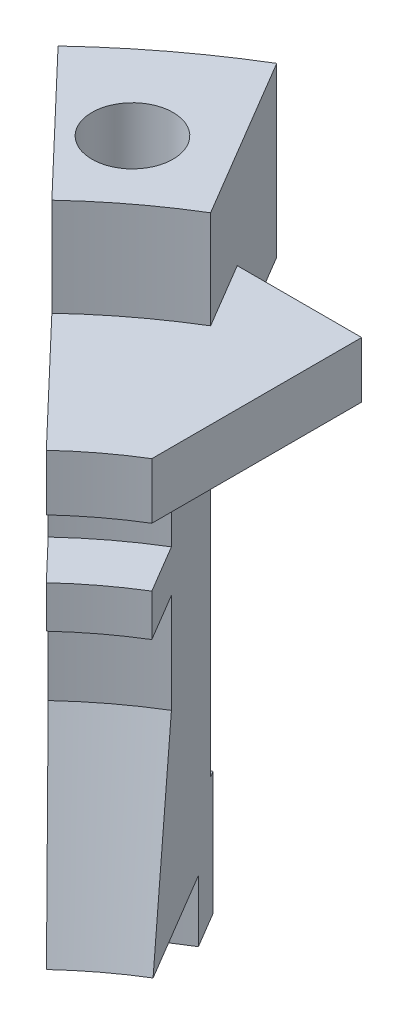
ISO-10303-21;
HEADER;
FILE_DESCRIPTION(('STEP AP214'),'2;1');
FILE_NAME('part.step','',(''),(''),'','','');
FILE_SCHEMA(('AUTOMOTIVE_DESIGN { 1 0 10303 214 1 1 1 1 }'));
ENDSEC;
DATA;
#1=APPLICATION_CONTEXT('core data for automotive mechanical design processes');
#2=APPLICATION_PROTOCOL_DEFINITION('international standard','automotive_design',2000,#1);
#3=PRODUCT_CONTEXT('',#1,'mechanical');
#4=PRODUCT('Part','Part','',(#3));
#5=PRODUCT_RELATED_PRODUCT_CATEGORY('part','',(#4));
#6=PRODUCT_DEFINITION_FORMATION('','',#4);
#7=PRODUCT_DEFINITION_CONTEXT('part definition',#1,'design');
#8=PRODUCT_DEFINITION('design','',#6,#7);
#9=PRODUCT_DEFINITION_SHAPE('','',#8);
#10=(LENGTH_UNIT() NAMED_UNIT(*) SI_UNIT(.MILLI.,.METRE.));
#11=(NAMED_UNIT(*) PLANE_ANGLE_UNIT() SI_UNIT($,.RADIAN.));
#12=(NAMED_UNIT(*) SI_UNIT($,.STERADIAN.) SOLID_ANGLE_UNIT());
#13=UNCERTAINTY_MEASURE_WITH_UNIT(LENGTH_MEASURE(1.E-05),#10,'distance_accuracy_value','');
#14=(GEOMETRIC_REPRESENTATION_CONTEXT(3) GLOBAL_UNCERTAINTY_ASSIGNED_CONTEXT((#13)) GLOBAL_UNIT_ASSIGNED_CONTEXT((#10,
#11,#12)) REPRESENTATION_CONTEXT('',''));
#15=CARTESIAN_POINT('',(0.,0.,0.));
#16=DIRECTION('',(0.,0.,1.));
#17=DIRECTION('',(1.,0.,0.));
#18=AXIS2_PLACEMENT_3D('',#15,#16,#17);
#19=CARTESIAN_POINT('',(0.,-20.2760820693015,0.));
#20=DIRECTION('',(0.,1.,0.));
#21=DIRECTION('',(0.,0.,1.));
#22=AXIS2_PLACEMENT_3D('',#19,#20,#21);
#23=CYLINDRICAL_SURFACE('',#22,19.6451475);
#24=DIRECTION('',(0.,1.,0.));
#25=VECTOR('',#24,1.);
#26=CARTESIAN_POINT('',(-10.1913484734592,-20.2760820693015,-16.7948872157356));
#27=LINE('',#26,#25);
#28=CARTESIAN_POINT('',(-10.1913484734592,-13.4325664147874,-16.7948872157356));
#29=VERTEX_POINT('',#28);
#30=CARTESIAN_POINT('',(-10.1913484734592,-1.97167284683422,-16.7948872157356));
#31=VERTEX_POINT('',#30);
#32=EDGE_CURVE('E350',#29,#31,#27,.T.);
#33=ORIENTED_EDGE('',*,*,#32,.F.);
#34=CARTESIAN_POINT('',(0.,-13.4325664147874,0.));
#35=DIRECTION('',(0.,1.,0.));
#36=DIRECTION('',(0.,0.,1.));
#37=AXIS2_PLACEMENT_3D('',#34,#35,#36);
#38=CIRCLE('',#37,19.6451475);
#39=CARTESIAN_POINT('',(-13.4188244794701,-13.4325664147874,-14.3480650223621));
#40=VERTEX_POINT('',#39);
#41=EDGE_CURVE('E352',#29,#40,#38,.T.);
#42=ORIENTED_EDGE('',*,*,#41,.T.);
#43=DIRECTION('',(0.,-1.,0.));
#44=VECTOR('',#43,1.);
#45=CARTESIAN_POINT('',(-13.4188244794701,-20.2760820693015,-14.3480650223621));
#46=LINE('',#45,#44);
#47=CARTESIAN_POINT('',(-13.4188244794701,-1.97167284683422,-14.3480650223621));
#48=VERTEX_POINT('',#47);
#49=EDGE_CURVE('E472',#48,#40,#46,.T.);
#50=ORIENTED_EDGE('',*,*,#49,.F.);
#51=CARTESIAN_POINT('',(0.,-1.97167284683422,0.));
#52=DIRECTION('',(0.,1.,0.));
#53=DIRECTION('',(0.,0.,1.));
#54=AXIS2_PLACEMENT_3D('',#51,#52,#53);
#55=CIRCLE('',#54,19.6451475);
#56=EDGE_CURVE('E387',#31,#48,#55,.T.);
#57=ORIENTED_EDGE('',*,*,#56,.F.);
#58=EDGE_LOOP('',(#33,#42,#50,#57));
#59=FACE_BOUND('',#58,.T.);
#60=ADVANCED_FACE('F39',(#59),#23,.T.);
#61=CARTESIAN_POINT('',(0.,-1.97167284683422,0.));
#62=DIRECTION('',(0.,-1.,0.));
#63=DIRECTION('',(0.,0.,-1.));
#64=AXIS2_PLACEMENT_3D('',#61,#62,#63);
#65=PLANE('',#64);
#66=CARTESIAN_POINT('',(-13.97,-1.97167284683422,-17.78));
#67=DIRECTION('',(0.,-1.,0.));
#68=DIRECTION('',(0.,0.,-1.));
#69=AXIS2_PLACEMENT_3D('',#66,#67,#68);
#70=CIRCLE('',#69,1.44999999999999);
#71=CARTESIAN_POINT('',(-13.97,-1.97167284683422,-19.23));
#72=VERTEX_POINT('',#71);
#73=EDGE_CURVE('E207',#72,#72,#70,.T.);
#74=ORIENTED_EDGE('',*,*,#73,.F.);
#75=EDGE_LOOP('',(#74));
#76=FACE_BOUND('',#75,.T.);
#77=DIRECTION('',(-0.510041360895566,0.,-0.860149876577216));
#78=VECTOR('',#77,1.);
#79=CARTESIAN_POINT('',(-0.172029975315443,-1.97167284683422,0.102008272179114));
#80=LINE('',#79,#78);
#81=CARTESIAN_POINT('',(-13.634260455702,-1.97167284683422,-22.6011228343381));
#82=VERTEX_POINT('',#81);
#83=EDGE_CURVE('E61',#31,#82,#80,.T.);
#84=ORIENTED_EDGE('',*,*,#83,.F.);
#85=ORIENTED_EDGE('',*,*,#56,.T.);
#86=DIRECTION('',(0.690460655488752,0.,0.723369949073116));
#87=VECTOR('',#86,1.);
#88=CARTESIAN_POINT('',(0.144673989814624,-1.97167284683422,-0.13809213109775));
#89=LINE('',#88,#87);
#90=CARTESIAN_POINT('',(-18.0796136748314,-1.97167284683422,-19.2310005177995));
#91=VERTEX_POINT('',#90);
#92=EDGE_CURVE('E355',#91,#48,#89,.T.);
#93=ORIENTED_EDGE('',*,*,#92,.F.);
#94=CARTESIAN_POINT('',(0.,-1.97167284683422,0.));
#95=DIRECTION('',(0.,1.,0.));
#96=DIRECTION('',(0.,0.,1.));
#97=AXIS2_PLACEMENT_3D('',#94,#95,#96);
#98=CIRCLE('',#97,26.3951475);
#99=EDGE_CURVE('E386',#82,#91,#98,.T.);
#100=ORIENTED_EDGE('',*,*,#99,.F.);
#101=EDGE_LOOP('',(#84,#85,#93,#100));
#102=FACE_BOUND('',#101,.T.);
#103=ADVANCED_FACE('F41',(#76,#102),#65,.T.);
#104=CARTESIAN_POINT('',(0.,-20.2760820693015,0.));
#105=DIRECTION('',(0.,1.,0.));
#106=DIRECTION('',(0.,0.,1.));
#107=AXIS2_PLACEMENT_3D('',#104,#105,#106);
#108=CYLINDRICAL_SURFACE('',#107,26.3951475);
#109=DIRECTION('',(0.,1.,0.));
#110=VECTOR('',#109,1.);
#111=CARTESIAN_POINT('',(-13.634260455702,-20.2760820693015,-22.6011228343381));
#112=LINE('',#111,#110);
#113=CARTESIAN_POINT('',(-13.634260455702,4.02832715316578,-22.6011228343381));
#114=VERTEX_POINT('',#113);
#115=EDGE_CURVE('E347',#82,#114,#112,.T.);
#116=ORIENTED_EDGE('',*,*,#115,.F.);
#117=ORIENTED_EDGE('',*,*,#99,.T.);
#118=DIRECTION('',(0.,-1.,0.));
#119=VECTOR('',#118,1.);
#120=CARTESIAN_POINT('',(-18.0796136748314,-20.2760820693015,-19.2310005177995));
#121=LINE('',#120,#119);
#122=CARTESIAN_POINT('',(-18.0796136748314,4.02832715316578,-19.2310005177995));
#123=VERTEX_POINT('',#122);
#124=EDGE_CURVE('E213',#123,#91,#121,.T.);
#125=ORIENTED_EDGE('',*,*,#124,.F.);
#126=CARTESIAN_POINT('',(0.,4.02832715316578,0.));
#127=DIRECTION('',(0.,1.,0.));
#128=DIRECTION('',(0.,0.,1.));
#129=AXIS2_PLACEMENT_3D('',#126,#127,#128);
#130=CIRCLE('',#129,26.3951475);
#131=EDGE_CURVE('E384',#114,#123,#130,.T.);
#132=ORIENTED_EDGE('',*,*,#131,.F.);
#133=EDGE_LOOP('',(#116,#117,#125,#132));
#134=FACE_BOUND('',#133,.T.);
#135=ADVANCED_FACE('F284',(#134),#108,.T.);
#136=CARTESIAN_POINT('',(0.,4.02832715316578,0.));
#137=DIRECTION('',(0.,-1.,0.));
#138=DIRECTION('',(0.,0.,-1.));
#139=AXIS2_PLACEMENT_3D('',#136,#137,#138);
#140=PLANE('',#139);
#141=CARTESIAN_POINT('',(-13.97,4.02832715316578,-17.78));
#142=DIRECTION('',(0.,-1.,0.));
#143=DIRECTION('',(0.,0.,-1.));
#144=AXIS2_PLACEMENT_3D('',#141,#142,#143);
#145=CIRCLE('',#144,1.45);
#146=CARTESIAN_POINT('',(-13.97,4.02832715316578,-19.23));
#147=VERTEX_POINT('',#146);
#148=EDGE_CURVE('E202',#147,#147,#145,.T.);
#149=ORIENTED_EDGE('',*,*,#148,.T.);
#150=EDGE_LOOP('',(#149));
#151=FACE_BOUND('',#150,.T.);
#152=CARTESIAN_POINT('',(0.,4.02832715316578,0.));
#153=DIRECTION('',(0.,1.,0.));
#154=DIRECTION('',(0.,0.,1.));
#155=AXIS2_PLACEMENT_3D('',#152,#153,#154);
#156=CIRCLE('',#155,19.6451475);
#157=CARTESIAN_POINT('',(-10.1913484734592,4.02832715316578,-16.7948872157356));
#158=VERTEX_POINT('',#157);
#159=CARTESIAN_POINT('',(-13.4188244794701,4.02832715316578,-14.3480650223621));
#160=VERTEX_POINT('',#159);
#161=EDGE_CURVE('E382',#158,#160,#156,.T.);
#162=ORIENTED_EDGE('',*,*,#161,.F.);
#163=DIRECTION('',(-0.510041360895566,0.,-0.860149876577216));
#164=VECTOR('',#163,1.);
#165=CARTESIAN_POINT('',(-0.172029975315444,4.02832715316578,0.102008272179112));
#166=LINE('',#165,#164);
#167=EDGE_CURVE('E344',#158,#114,#166,.T.);
#168=ORIENTED_EDGE('',*,*,#167,.T.);
#169=ORIENTED_EDGE('',*,*,#131,.T.);
#170=DIRECTION('',(0.690460655488752,0.,0.723369949073116));
#171=VECTOR('',#170,1.);
#172=CARTESIAN_POINT('',(0.144673989814622,4.02832715316578,-0.138092131097752));
#173=LINE('',#172,#171);
#174=EDGE_CURVE('E217',#123,#160,#173,.T.);
#175=ORIENTED_EDGE('',*,*,#174,.T.);
#176=EDGE_LOOP('',(#162,#168,#169,#175));
#177=FACE_BOUND('',#176,.T.);
#178=ADVANCED_FACE('F460',(#151,#177),#140,.F.);
#179=CARTESIAN_POINT('',(0.,-20.2760820693015,0.));
#180=DIRECTION('',(0.,1.,0.));
#181=DIRECTION('',(0.,0.,1.));
#182=AXIS2_PLACEMENT_3D('',#179,#180,#181);
#183=CYLINDRICAL_SURFACE('',#182,19.6451475);
#184=CARTESIAN_POINT('',(0.,0.528327153165784,0.));
#185=DIRECTION('',(0.,1.,0.));
#186=DIRECTION('',(0.,0.,1.));
#187=AXIS2_PLACEMENT_3D('',#184,#185,#186);
#188=CIRCLE('',#187,19.6451475);
#189=CARTESIAN_POINT('',(-10.1913484734592,0.528327153165784,-16.7948872157356));
#190=VERTEX_POINT('',#189);
#191=CARTESIAN_POINT('',(-13.4188244794701,0.528327153165788,-14.3480650223621));
#192=VERTEX_POINT('',#191);
#193=EDGE_CURVE('E380',#190,#192,#188,.T.);
#194=ORIENTED_EDGE('',*,*,#193,.F.);
#195=DIRECTION('',(0.,1.,0.));
#196=VECTOR('',#195,1.);
#197=CARTESIAN_POINT('',(-10.1913484734592,-20.2760820693015,-16.7948872157356));
#198=LINE('',#197,#196);
#199=EDGE_CURVE('E341',#190,#158,#198,.T.);
#200=ORIENTED_EDGE('',*,*,#199,.T.);
#201=ORIENTED_EDGE('',*,*,#161,.T.);
#202=DIRECTION('',(0.,-1.,0.));
#203=VECTOR('',#202,1.);
#204=CARTESIAN_POINT('',(-13.4188244794701,-20.2760820693015,-14.3480650223621));
#205=LINE('',#204,#203);
#206=EDGE_CURVE('E220',#160,#192,#205,.T.);
#207=ORIENTED_EDGE('',*,*,#206,.T.);
#208=EDGE_LOOP('',(#194,#200,#201,#207));
#209=FACE_BOUND('',#208,.T.);
#210=ADVANCED_FACE('F456',(#209),#183,.F.);
#211=CARTESIAN_POINT('',(0.,0.528327153165786,0.));
#212=DIRECTION('',(0.,1.,0.));
#213=DIRECTION('',(0.,0.,1.));
#214=AXIS2_PLACEMENT_3D('',#211,#212,#213);
#215=PLANE('',#214);
#216=CARTESIAN_POINT('',(0.,0.528327153165788,0.));
#217=DIRECTION('',(0.,1.,0.));
#218=DIRECTION('',(0.,0.,1.));
#219=AXIS2_PLACEMENT_3D('',#216,#217,#218);
#220=CIRCLE('',#219,13.6451475);
#221=CARTESIAN_POINT('',(-7.1308719565709,0.528327153165784,-11.633602857058));
#222=VERTEX_POINT('',#221);
#223=CARTESIAN_POINT('',(-9.27575141918295,0.528327153165788,-10.007521466691));
#224=VERTEX_POINT('',#223);
#225=EDGE_CURVE('E378',#222,#224,#220,.T.);
#226=ORIENTED_EDGE('',*,*,#225,.F.);
#227=DIRECTION('',(0.,0.,-1.));
#228=VECTOR('',#227,1.);
#229=CARTESIAN_POINT('',(-7.1308719565709,0.528327153165786,0.));
#230=LINE('',#229,#228);
#231=CARTESIAN_POINT('',(-7.1308719565709,0.528327153165786,-19.133602857058));
#232=VERTEX_POINT('',#231);
#233=EDGE_CURVE('E204',#222,#232,#230,.T.);
#234=ORIENTED_EDGE('',*,*,#233,.T.);
#235=DIRECTION('',(-1.,0.,0.));
#236=VECTOR('',#235,1.);
#237=CARTESIAN_POINT('',(0.,0.528327153165786,-19.133602857058));
#238=LINE('',#237,#236);
#239=CARTESIAN_POINT('',(-11.5781320340108,0.528327153165789,-19.133602857058));
#240=VERTEX_POINT('',#239);
#241=EDGE_CURVE('E187',#232,#240,#238,.T.);
#242=ORIENTED_EDGE('',*,*,#241,.T.);
#243=DIRECTION('',(-0.510041360895566,0.,-0.860149876577216));
#244=VECTOR('',#243,1.);
#245=CARTESIAN_POINT('',(-0.172029975315441,0.528327153165786,0.102008272179112));
#246=LINE('',#245,#244);
#247=EDGE_CURVE('E12',#190,#240,#246,.T.);
#248=ORIENTED_EDGE('',*,*,#247,.F.);
#249=ORIENTED_EDGE('',*,*,#193,.T.);
#250=DIRECTION('',(-0.690460655488752,0.,-0.723369949073116));
#251=VECTOR('',#250,1.);
#252=CARTESIAN_POINT('',(0.144673989814623,0.528327153165786,-0.138092131097751));
#253=LINE('',#252,#251);
#254=EDGE_CURVE('E223',#224,#192,#253,.T.);
#255=ORIENTED_EDGE('',*,*,#254,.F.);
#256=EDGE_LOOP('',(#226,#234,#242,#248,#249,#255));
#257=FACE_BOUND('',#256,.T.);
#258=ADVANCED_FACE('F452',(#257),#215,.T.);
#259=CARTESIAN_POINT('',(0.,-20.2760820693015,0.));
#260=DIRECTION('',(0.,1.,0.));
#261=DIRECTION('',(0.,0.,1.));
#262=AXIS2_PLACEMENT_3D('',#259,#260,#261);
#263=CYLINDRICAL_SURFACE('',#262,13.6451475);
#264=CARTESIAN_POINT('',(0.,-1.47167284683421,0.));
#265=DIRECTION('',(0.,1.,0.));
#266=DIRECTION('',(0.,0.,1.));
#267=AXIS2_PLACEMENT_3D('',#264,#265,#266);
#268=CIRCLE('',#267,13.6451475);
#269=CARTESIAN_POINT('',(-7.1308719565709,-1.47167284683421,-11.633602857058));
#270=VERTEX_POINT('',#269);
#271=CARTESIAN_POINT('',(-9.27575141918295,-1.47167284683421,-10.007521466691));
#272=VERTEX_POINT('',#271);
#273=EDGE_CURVE('E376',#270,#272,#268,.T.);
#274=ORIENTED_EDGE('',*,*,#273,.F.);
#275=DIRECTION('',(0.,1.,0.));
#276=VECTOR('',#275,1.);
#277=CARTESIAN_POINT('',(-7.1308719565709,-20.2760820693015,-11.633602857058));
#278=LINE('',#277,#276);
#279=EDGE_CURVE('E339',#270,#222,#278,.T.);
#280=ORIENTED_EDGE('',*,*,#279,.T.);
#281=ORIENTED_EDGE('',*,*,#225,.T.);
#282=DIRECTION('',(0.,-1.,0.));
#283=VECTOR('',#282,1.);
#284=CARTESIAN_POINT('',(-9.27575141918295,-20.2760820693015,-10.007521466691));
#285=LINE('',#284,#283);
#286=EDGE_CURVE('E226',#224,#272,#285,.T.);
#287=ORIENTED_EDGE('',*,*,#286,.T.);
#288=EDGE_LOOP('',(#274,#280,#281,#287));
#289=FACE_BOUND('',#288,.T.);
#290=ADVANCED_FACE('F439',(#289),#263,.F.);
#291=CARTESIAN_POINT('',(0.,-1.47167284683421,0.));
#292=DIRECTION('',(0.,-1.,0.));
#293=DIRECTION('',(0.,0.,-1.));
#294=AXIS2_PLACEMENT_3D('',#291,#292,#293);
#295=PLANE('',#294);
#296=CARTESIAN_POINT('',(0.,-1.47167284683421,0.));
#297=DIRECTION('',(0.,1.,0.));
#298=DIRECTION('',(0.,0.,1.));
#299=AXIS2_PLACEMENT_3D('',#296,#297,#298);
#300=CIRCLE('',#299,15.6451475);
#301=CARTESIAN_POINT('',(-8.15105025877613,-1.47167284683422,-13.3540638000446));
#302=VERTEX_POINT('',#301);
#303=CARTESIAN_POINT('',(-10.6568021206774,-1.47167284683421,-11.4543969224696));
#304=VERTEX_POINT('',#303);
#305=EDGE_CURVE('E197',#302,#304,#300,.T.);
#306=ORIENTED_EDGE('',*,*,#305,.F.);
#307=DIRECTION('',(-0.510041360895566,0.,-0.860149876577216));
#308=VECTOR('',#307,1.);
#309=CARTESIAN_POINT('',(-0.172029975315441,-1.47167284683421,0.102008272179112));
#310=LINE('',#309,#308);
#311=CARTESIAN_POINT('',(-11.5781320340108,-1.47167284683421,-19.133602857058));
#312=VERTEX_POINT('',#311);
#313=EDGE_CURVE('E48',#302,#312,#310,.T.);
#314=ORIENTED_EDGE('',*,*,#313,.T.);
#315=DIRECTION('',(-1.,0.,0.));
#316=VECTOR('',#315,1.);
#317=CARTESIAN_POINT('',(0.,-1.47167284683421,-19.133602857058));
#318=LINE('',#317,#316);
#319=CARTESIAN_POINT('',(-7.1308719565709,-1.47167284683421,-19.133602857058));
#320=VERTEX_POINT('',#319);
#321=EDGE_CURVE('E194',#320,#312,#318,.T.);
#322=ORIENTED_EDGE('',*,*,#321,.F.);
#323=DIRECTION('',(0.,0.,-1.));
#324=VECTOR('',#323,1.);
#325=CARTESIAN_POINT('',(-7.1308719565709,-1.47167284683421,0.));
#326=LINE('',#325,#324);
#327=EDGE_CURVE('E201',#270,#320,#326,.T.);
#328=ORIENTED_EDGE('',*,*,#327,.F.);
#329=ORIENTED_EDGE('',*,*,#273,.T.);
#330=DIRECTION('',(0.690460655488752,0.,0.723369949073116));
#331=VECTOR('',#330,1.);
#332=CARTESIAN_POINT('',(0.144673989814623,-1.47167284683421,-0.138092131097751));
#333=LINE('',#332,#331);
#334=EDGE_CURVE('E229',#304,#272,#333,.T.);
#335=ORIENTED_EDGE('',*,*,#334,.F.);
#336=EDGE_LOOP('',(#306,#314,#322,#328,#329,#335));
#337=FACE_BOUND('',#336,.T.);
#338=ADVANCED_FACE('F192',(#337),#295,.T.);
#339=CARTESIAN_POINT('',(0.,-20.2760820693015,0.));
#340=DIRECTION('',(0.,1.,0.));
#341=DIRECTION('',(0.,0.,1.));
#342=AXIS2_PLACEMENT_3D('',#339,#340,#341);
#343=CYLINDRICAL_SURFACE('',#342,15.6451475);
#344=DIRECTION('',(0.,1.,0.));
#345=VECTOR('',#344,1.);
#346=CARTESIAN_POINT('',(-8.15105025877613,-20.2760820693015,-13.3540638000446));
#347=LINE('',#346,#345);
#348=CARTESIAN_POINT('',(-8.15105025877613,-3.57167284683421,-13.3540638000446));
#349=VERTEX_POINT('',#348);
#350=EDGE_CURVE('E337',#302,#349,#347,.F.);
#351=ORIENTED_EDGE('',*,*,#350,.F.);
#352=ORIENTED_EDGE('',*,*,#305,.T.);
#353=DIRECTION('',(0.,-1.,0.));
#354=VECTOR('',#353,1.);
#355=CARTESIAN_POINT('',(-10.6568021206774,-20.2760820693015,-11.4543969224696));
#356=LINE('',#355,#354);
#357=CARTESIAN_POINT('',(-10.6568021206774,-3.57167284683421,-11.4543969224696));
#358=VERTEX_POINT('',#357);
#359=EDGE_CURVE('E232',#358,#304,#356,.F.);
#360=ORIENTED_EDGE('',*,*,#359,.F.);
#361=CARTESIAN_POINT('',(0.,-3.57167284683421,0.));
#362=DIRECTION('',(0.,1.,0.));
#363=DIRECTION('',(0.,0.,1.));
#364=AXIS2_PLACEMENT_3D('',#361,#362,#363);
#365=CIRCLE('',#364,15.6451475);
#366=EDGE_CURVE('E373',#349,#358,#365,.T.);
#367=ORIENTED_EDGE('',*,*,#366,.F.);
#368=EDGE_LOOP('',(#351,#352,#360,#367));
#369=FACE_BOUND('',#368,.T.);
#370=ADVANCED_FACE('F432',(#369),#343,.F.);
#371=CARTESIAN_POINT('',(0.,-3.57167284683421,0.));
#372=DIRECTION('',(0.,-1.,0.));
#373=DIRECTION('',(0.,0.,-1.));
#374=AXIS2_PLACEMENT_3D('',#371,#372,#373);
#375=PLANE('',#374);
#376=CARTESIAN_POINT('',(0.,-3.57167284683421,0.));
#377=DIRECTION('',(0.,1.,0.));
#378=DIRECTION('',(0.,0.,1.));
#379=AXIS2_PLACEMENT_3D('',#376,#377,#378);
#380=CIRCLE('',#379,13.6451475);
#381=CARTESIAN_POINT('',(-7.1308719565709,-3.57167284683421,-11.633602857058));
#382=VERTEX_POINT('',#381);
#383=CARTESIAN_POINT('',(-9.27575141918295,-3.57167284683421,-10.007521466691));
#384=VERTEX_POINT('',#383);
#385=EDGE_CURVE('E371',#382,#384,#380,.T.);
#386=ORIENTED_EDGE('',*,*,#385,.F.);
#387=DIRECTION('',(-0.510041360895566,0.,-0.860149876577216));
#388=VECTOR('',#387,1.);
#389=CARTESIAN_POINT('',(-0.172029975315443,-3.57167284683421,0.102008272179113));
#390=LINE('',#389,#388);
#391=EDGE_CURVE('E334',#382,#349,#390,.T.);
#392=ORIENTED_EDGE('',*,*,#391,.T.);
#393=ORIENTED_EDGE('',*,*,#366,.T.);
#394=DIRECTION('',(0.690460655488752,0.,0.723369949073116));
#395=VECTOR('',#394,1.);
#396=CARTESIAN_POINT('',(0.144673989814623,-3.57167284683421,-0.138092131097751));
#397=LINE('',#396,#395);
#398=EDGE_CURVE('E235',#358,#384,#397,.T.);
#399=ORIENTED_EDGE('',*,*,#398,.T.);
#400=EDGE_LOOP('',(#386,#392,#393,#399));
#401=FACE_BOUND('',#400,.T.);
#402=ADVANCED_FACE('F428',(#401),#375,.F.);
#403=CARTESIAN_POINT('',(0.,-20.2760820693015,0.));
#404=DIRECTION('',(0.,1.,0.));
#405=DIRECTION('',(0.,0.,1.));
#406=AXIS2_PLACEMENT_3D('',#403,#404,#405);
#407=CYLINDRICAL_SURFACE('',#406,13.6451475);
#408=CARTESIAN_POINT('',(0.,-5.07167284683421,0.));
#409=DIRECTION('',(0.,1.,0.));
#410=DIRECTION('',(0.,0.,1.));
#411=AXIS2_PLACEMENT_3D('',#408,#409,#410);
#412=CIRCLE('',#411,13.6451475);
#413=CARTESIAN_POINT('',(-7.1308719565709,-5.07167284683421,-11.633602857058));
#414=VERTEX_POINT('',#413);
#415=CARTESIAN_POINT('',(-9.27575141918295,-5.07167284683421,-10.007521466691));
#416=VERTEX_POINT('',#415);
#417=EDGE_CURVE('E369',#414,#416,#412,.T.);
#418=ORIENTED_EDGE('',*,*,#417,.F.);
#419=DIRECTION('',(0.,1.,0.));
#420=VECTOR('',#419,1.);
#421=CARTESIAN_POINT('',(-7.1308719565709,-20.2760820693015,-11.633602857058));
#422=LINE('',#421,#420);
#423=EDGE_CURVE('E331',#414,#382,#422,.T.);
#424=ORIENTED_EDGE('',*,*,#423,.T.);
#425=ORIENTED_EDGE('',*,*,#385,.T.);
#426=DIRECTION('',(0.,-1.,0.));
#427=VECTOR('',#426,1.);
#428=CARTESIAN_POINT('',(-9.27575141918295,-20.2760820693015,-10.007521466691));
#429=LINE('',#428,#427);
#430=EDGE_CURVE('E238',#384,#416,#429,.T.);
#431=ORIENTED_EDGE('',*,*,#430,.T.);
#432=EDGE_LOOP('',(#418,#424,#425,#431));
#433=FACE_BOUND('',#432,.T.);
#434=ADVANCED_FACE('F425',(#433),#407,.F.);
#435=CARTESIAN_POINT('',(0.,-5.07167284683421,0.));
#436=DIRECTION('',(0.,-1.,0.));
#437=DIRECTION('',(0.,0.,-1.));
#438=AXIS2_PLACEMENT_3D('',#435,#436,#437);
#439=PLANE('',#438);
#440=DIRECTION('',(-0.510041360895566,0.,-0.860149876577216));
#441=VECTOR('',#440,1.);
#442=CARTESIAN_POINT('',(-0.172029975315443,-5.07167284683421,0.102008272179113));
#443=LINE('',#442,#441);
#444=CARTESIAN_POINT('',(-8.15105025877613,-5.07167284683421,-13.3540638000446));
#445=VERTEX_POINT('',#444);
#446=EDGE_CURVE('E329',#414,#445,#443,.T.);
#447=ORIENTED_EDGE('',*,*,#446,.F.);
#448=ORIENTED_EDGE('',*,*,#417,.T.);
#449=DIRECTION('',(0.690460655488752,0.,0.723369949073116));
#450=VECTOR('',#449,1.);
#451=CARTESIAN_POINT('',(0.144673989814623,-5.07167284683421,-0.138092131097751));
#452=LINE('',#451,#450);
#453=CARTESIAN_POINT('',(-10.6568021206774,-5.07167284683421,-11.4543969224696));
#454=VERTEX_POINT('',#453);
#455=EDGE_CURVE('E241',#454,#416,#452,.T.);
#456=ORIENTED_EDGE('',*,*,#455,.F.);
#457=CARTESIAN_POINT('',(0.,-5.07167284683421,0.));
#458=DIRECTION('',(0.,1.,0.));
#459=DIRECTION('',(0.,0.,1.));
#460=AXIS2_PLACEMENT_3D('',#457,#458,#459);
#461=CIRCLE('',#460,15.6451475);
#462=EDGE_CURVE('E367',#445,#454,#461,.T.);
#463=ORIENTED_EDGE('',*,*,#462,.F.);
#464=EDGE_LOOP('',(#447,#448,#456,#463));
#465=FACE_BOUND('',#464,.T.);
#466=ADVANCED_FACE('F420',(#465),#439,.T.);
#467=DIRECTION('',(0.,1.,0.));
#468=VECTOR('',#467,1.);
#469=CARTESIAN_POINT('',(-8.15105025877613,-20.2760820693015,-13.3540638000446));
#470=LINE('',#469,#468);
#471=CARTESIAN_POINT('',(-8.15105025877613,-8.63256641478738,-13.3540638000446));
#472=VERTEX_POINT('',#471);
#473=EDGE_CURVE('E325',#445,#472,#470,.F.);
#474=ORIENTED_EDGE('',*,*,#473,.F.);
#475=ORIENTED_EDGE('',*,*,#462,.T.);
#476=DIRECTION('',(0.,-1.,0.));
#477=VECTOR('',#476,1.);
#478=CARTESIAN_POINT('',(-10.6568021206774,-20.2760820693015,-11.4543969224696));
#479=LINE('',#478,#477);
#480=CARTESIAN_POINT('',(-10.6568021206774,-8.63256641478738,-11.4543969224696));
#481=VERTEX_POINT('',#480);
#482=EDGE_CURVE('E244',#481,#454,#479,.F.);
#483=ORIENTED_EDGE('',*,*,#482,.F.);
#484=CARTESIAN_POINT('',(0.,-8.63256641478738,0.));
#485=DIRECTION('',(0.,1.,0.));
#486=DIRECTION('',(0.,0.,1.));
#487=AXIS2_PLACEMENT_3D('',#484,#485,#486);
#488=CIRCLE('',#487,15.6451475);
#489=EDGE_CURVE('E365',#472,#481,#488,.T.);
#490=ORIENTED_EDGE('',*,*,#489,.F.);
#491=EDGE_LOOP('',(#474,#475,#483,#490));
#492=FACE_BOUND('',#491,.T.);
#493=ADVANCED_FACE('F313',(#492),#343,.F.);
#494=CARTESIAN_POINT('',(0.,-8.63256641478738,0.));
#495=DIRECTION('',(0.,1.,0.));
#496=DIRECTION('',(0.,0.,1.));
#497=AXIS2_PLACEMENT_3D('',#494,#495,#496);
#498=CONICAL_SURFACE('',#497,15.6451475,0.261799387799143);
#499=CARTESIAN_POINT('',(0.,-15.6325664147874,0.));
#500=DIRECTION('',(0.,1.,0.));
#501=DIRECTION('',(0.,0.,1.));
#502=AXIS2_PLACEMENT_3D('',#499,#500,#501);
#503=CIRCLE('',#502,13.7695031529822);
#504=CARTESIAN_POINT('',(-7.19430523569571,-15.6325664147874,-11.7405787444924));
#505=VERTEX_POINT('',#504);
#506=CARTESIAN_POINT('',(-9.36162324614109,-15.6325664147874,-10.0974861860414));
#507=VERTEX_POINT('',#506);
#508=EDGE_CURVE('E363',#505,#507,#503,.T.);
#509=ORIENTED_EDGE('',*,*,#508,.F.);
#510=CARTESIAN_POINT('',(-7.19427789977785,-15.6327664147874,-11.7405326443363));
#511=CARTESIAN_POINT('',(-7.35374627749216,-14.4660340072047,-12.0094651582957));
#512=CARTESIAN_POINT('',(-7.51321377420483,-13.2993011367466,-12.2783961865061));
#513=CARTESIAN_POINT('',(-7.83214700562685,-10.9658344700799,-12.8162552714289));
#514=CARTESIAN_POINT('',(-7.9916127403362,-9.79910067387135,-13.0851833281412));
#515=CARTESIAN_POINT('',(-8.15107759404391,-8.63236641478738,-13.3541098991044));
#516=B_SPLINE_CURVE_WITH_KNOTS('',3,(#510,#511,#512,#513,#514,#515),.UNSPECIFIED.,.F.,.F.,(4,2,
4),(0.,3.62369622665113,7.24739245330126),.UNSPECIFIED.);
#517=EDGE_CURVE('E317',#505,#472,#516,.T.);
#518=ORIENTED_EDGE('',*,*,#517,.T.);
#519=ORIENTED_EDGE('',*,*,#489,.T.);
#520=CARTESIAN_POINT('',(-10.6568391253762,-8.63236641478738,-11.4544356909162));
#521=CARTESIAN_POINT('',(-10.4409660298588,-9.79910067387135,-11.2282734775166));
#522=CARTESIAN_POINT('',(-10.2250917416989,-10.9658344700799,-11.0021100146298));
#523=CARTESIAN_POINT('',(-9.79334078009429,-13.2993011367466,-10.549780589882));
#524=CARTESIAN_POINT('',(-9.57746410664951,-14.4660340072047,-10.323614628021));
#525=CARTESIAN_POINT('',(-9.36158624056231,-15.6327664147874,-10.0974474166728));
#526=B_SPLINE_CURVE_WITH_KNOTS('',3,(#520,#521,#522,#523,#524,#525),.UNSPECIFIED.,.F.,.F.,(4,2,
4),(0.,3.62369622665012,7.24739245330126),.UNSPECIFIED.);
#527=EDGE_CURVE('E247',#481,#507,#526,.T.);
#528=ORIENTED_EDGE('',*,*,#527,.T.);
#529=EDGE_LOOP('',(#509,#518,#519,#528));
#530=FACE_BOUND('',#529,.T.);
#531=ADVANCED_FACE('F308',(#530),#498,.F.);
#532=CARTESIAN_POINT('',(0.,-15.6325664147874,0.));
#533=DIRECTION('',(0.,-1.,0.));
#534=DIRECTION('',(0.,0.,-1.));
#535=AXIS2_PLACEMENT_3D('',#532,#533,#534);
#536=PLANE('',#535);
#537=DIRECTION('',(-0.510041360895566,0.,-0.860149876577216));
#538=VECTOR('',#537,1.);
#539=CARTESIAN_POINT('',(-0.172029975315443,-15.6325664147874,0.102008272179113));
#540=LINE('',#539,#538);
#541=CARTESIAN_POINT('',(-9.55376148467298,-15.6325664147874,-15.7196403597772));
#542=VERTEX_POINT('',#541);
#543=EDGE_CURVE('E326',#505,#542,#540,.T.);
#544=ORIENTED_EDGE('',*,*,#543,.F.);
#545=ORIENTED_EDGE('',*,*,#508,.T.);
#546=DIRECTION('',(0.690460655488752,0.,0.723369949073116));
#547=VECTOR('',#546,1.);
#548=CARTESIAN_POINT('',(0.144673989814623,-15.6325664147874,-0.138092131097751));
#549=LINE('',#548,#547);
#550=CARTESIAN_POINT('',(-12.5557008899725,-15.6325664147874,-13.4438025390252));
#551=VERTEX_POINT('',#550);
#552=EDGE_CURVE('E256',#551,#507,#549,.T.);
#553=ORIENTED_EDGE('',*,*,#552,.F.);
#554=CARTESIAN_POINT('',(0.,-15.6325664147874,0.));
#555=DIRECTION('',(0.,1.,0.));
#556=DIRECTION('',(0.,0.,1.));
#557=AXIS2_PLACEMENT_3D('',#554,#555,#556);
#558=CIRCLE('',#557,18.3951475);
#559=EDGE_CURVE('E361',#542,#551,#558,.T.);
#560=ORIENTED_EDGE('',*,*,#559,.F.);
#561=EDGE_LOOP('',(#544,#545,#553,#560));
#562=FACE_BOUND('',#561,.T.);
#563=ADVANCED_FACE('F304',(#562),#536,.T.);
#564=CARTESIAN_POINT('',(0.,-20.2760820693015,0.));
#565=DIRECTION('',(0.,1.,0.));
#566=DIRECTION('',(0.,0.,1.));
#567=AXIS2_PLACEMENT_3D('',#564,#565,#566);
#568=CYLINDRICAL_SURFACE('',#567,18.3951475);
#569=CARTESIAN_POINT('',(0.,-17.8325664147874,0.));
#570=DIRECTION('',(0.,1.,0.));
#571=DIRECTION('',(0.,0.,1.));
#572=AXIS2_PLACEMENT_3D('',#569,#570,#571);
#573=CIRCLE('',#572,18.3951475);
#574=CARTESIAN_POINT('',(-9.55376148467298,-17.8325664147874,-15.7196403597772));
#575=VERTEX_POINT('',#574);
#576=CARTESIAN_POINT('',(-12.5557008899725,-17.8325664147874,-13.4438025390252));
#577=VERTEX_POINT('',#576);
#578=EDGE_CURVE('E359',#575,#577,#573,.T.);
#579=ORIENTED_EDGE('',*,*,#578,.F.);
#580=DIRECTION('',(0.,1.,0.));
#581=VECTOR('',#580,1.);
#582=CARTESIAN_POINT('',(-9.55376148467298,-20.2760820693015,-15.7196403597772));
#583=LINE('',#582,#581);
#584=EDGE_CURVE('E398',#575,#542,#583,.T.);
#585=ORIENTED_EDGE('',*,*,#584,.T.);
#586=ORIENTED_EDGE('',*,*,#559,.T.);
#587=DIRECTION('',(0.,-1.,0.));
#588=VECTOR('',#587,1.);
#589=CARTESIAN_POINT('',(-12.5557008899725,-20.2760820693015,-13.4438025390252));
#590=LINE('',#589,#588);
#591=EDGE_CURVE('E483',#551,#577,#590,.T.);
#592=ORIENTED_EDGE('',*,*,#591,.T.);
#593=EDGE_LOOP('',(#579,#585,#586,#592));
#594=FACE_BOUND('',#593,.T.);
#595=ADVANCED_FACE('F300',(#594),#568,.F.);
#596=CARTESIAN_POINT('',(0.,-17.8325664147874,0.));
#597=DIRECTION('',(0.,1.,0.));
#598=DIRECTION('',(0.,0.,1.));
#599=AXIS2_PLACEMENT_3D('',#596,#597,#598);
#600=PLANE('',#599);
#601=CARTESIAN_POINT('',(0.,-17.8325664147874,0.));
#602=DIRECTION('',(0.,1.,0.));
#603=DIRECTION('',(0.,0.,1.));
#604=AXIS2_PLACEMENT_3D('',#601,#602,#603);
#605=CIRCLE('',#604,19.8951475);
#606=CARTESIAN_POINT('',(-10.3188653390702,-17.8325664147874,-17.009935689499));
#607=VERTEX_POINT('',#606);
#608=CARTESIAN_POINT('',(-13.5914484769848,-17.8325664147874,-14.5289167643091));
#609=VERTEX_POINT('',#608);
#610=EDGE_CURVE('E357',#607,#609,#605,.T.);
#611=ORIENTED_EDGE('',*,*,#610,.F.);
#612=DIRECTION('',(0.510041360895566,0.,0.860149876577216));
#613=VECTOR('',#612,1.);
#614=CARTESIAN_POINT('',(-0.172029975315443,-17.8325664147874,0.102008272179113));
#615=LINE('',#614,#613);
#616=EDGE_CURVE('E393',#607,#575,#615,.T.);
#617=ORIENTED_EDGE('',*,*,#616,.T.);
#618=ORIENTED_EDGE('',*,*,#578,.T.);
#619=DIRECTION('',(-0.690460655488752,0.,-0.723369949073116));
#620=VECTOR('',#619,1.);
#621=CARTESIAN_POINT('',(0.144673989814623,-17.8325664147874,-0.138092131097751));
#622=LINE('',#621,#620);
#623=EDGE_CURVE('E481',#577,#609,#622,.T.);
#624=ORIENTED_EDGE('',*,*,#623,.T.);
#625=EDGE_LOOP('',(#611,#617,#618,#624));
#626=FACE_BOUND('',#625,.T.);
#627=ADVANCED_FACE('F296',(#626),#600,.F.);
#628=CARTESIAN_POINT('',(0.,-20.2760820693015,0.));
#629=DIRECTION('',(0.,1.,0.));
#630=DIRECTION('',(0.,0.,1.));
#631=AXIS2_PLACEMENT_3D('',#628,#629,#630);
#632=CYLINDRICAL_SURFACE('',#631,19.8951475);
#633=DIRECTION('',(0.,1.,0.));
#634=VECTOR('',#633,1.);
#635=CARTESIAN_POINT('',(-10.3188653390702,-20.2760820693015,-17.009935689499));
#636=LINE('',#635,#634);
#637=CARTESIAN_POINT('',(-10.3188653390702,-13.4325664147874,-17.009935689499));
#638=VERTEX_POINT('',#637);
#639=EDGE_CURVE('E388',#607,#638,#636,.T.);
#640=ORIENTED_EDGE('',*,*,#639,.F.);
#641=ORIENTED_EDGE('',*,*,#610,.T.);
#642=DIRECTION('',(0.,-1.,0.));
#643=VECTOR('',#642,1.);
#644=CARTESIAN_POINT('',(-13.5914484769848,-20.2760820693015,-14.5289167643091));
#645=LINE('',#644,#643);
#646=CARTESIAN_POINT('',(-13.5914484769848,-13.4325664147874,-14.5289167643091));
#647=VERTEX_POINT('',#646);
#648=EDGE_CURVE('E476',#647,#609,#645,.T.);
#649=ORIENTED_EDGE('',*,*,#648,.F.);
#650=CARTESIAN_POINT('',(0.,-13.4325664147874,0.));
#651=DIRECTION('',(0.,1.,0.));
#652=DIRECTION('',(0.,0.,1.));
#653=AXIS2_PLACEMENT_3D('',#650,#651,#652);
#654=CIRCLE('',#653,19.8951475);
#655=EDGE_CURVE('E354',#638,#647,#654,.T.);
#656=ORIENTED_EDGE('',*,*,#655,.F.);
#657=EDGE_LOOP('',(#640,#641,#649,#656));
#658=FACE_BOUND('',#657,.T.);
#659=ADVANCED_FACE('F292',(#658),#632,.T.);
#660=CARTESIAN_POINT('',(0.,-13.4325664147874,0.));
#661=DIRECTION('',(0.,1.,0.));
#662=DIRECTION('',(0.,0.,1.));
#663=AXIS2_PLACEMENT_3D('',#660,#661,#662);
#664=PLANE('',#663);
#665=DIRECTION('',(0.510041360895566,0.,0.860149876577216));
#666=VECTOR('',#665,1.);
#667=CARTESIAN_POINT('',(-0.172029975315443,-13.4325664147874,0.102008272179113));
#668=LINE('',#667,#666);
#669=EDGE_CURVE('E43',#638,#29,#668,.T.);
#670=ORIENTED_EDGE('',*,*,#669,.F.);
#671=ORIENTED_EDGE('',*,*,#655,.T.);
#672=DIRECTION('',(-0.690460655488752,0.,-0.723369949073116));
#673=VECTOR('',#672,1.);
#674=CARTESIAN_POINT('',(0.144673989814623,-13.4325664147874,-0.138092131097751));
#675=LINE('',#674,#673);
#676=EDGE_CURVE('E473',#40,#647,#675,.T.);
#677=ORIENTED_EDGE('',*,*,#676,.F.);
#678=ORIENTED_EDGE('',*,*,#41,.F.);
#679=EDGE_LOOP('',(#670,#671,#677,#678));
#680=FACE_BOUND('',#679,.T.);
#681=ADVANCED_FACE('F289',(#680),#664,.T.);
#682=CARTESIAN_POINT('',(-0.172029975315443,38.961084754454,0.102008272179113));
#683=DIRECTION('',(-0.860149876577216,0.,0.510041360895566));
#684=DIRECTION('',(-0.510041360895566,0.,-0.860149876577216));
#685=AXIS2_PLACEMENT_3D('',#682,#683,#684);
#686=PLANE('',#685);
#687=ORIENTED_EDGE('',*,*,#199,.F.);
#688=ORIENTED_EDGE('',*,*,#247,.T.);
#689=DIRECTION('',(0.,-1.,0.));
#690=VECTOR('',#689,1.);
#691=CARTESIAN_POINT('',(-11.5781320340108,9.24773780964889,-19.133602857058));
#692=LINE('',#691,#690);
#693=EDGE_CURVE('E179',#240,#312,#692,.T.);
#694=ORIENTED_EDGE('',*,*,#693,.T.);
#695=ORIENTED_EDGE('',*,*,#313,.F.);
#696=ORIENTED_EDGE('',*,*,#350,.T.);
#697=ORIENTED_EDGE('',*,*,#391,.F.);
#698=ORIENTED_EDGE('',*,*,#423,.F.);
#699=ORIENTED_EDGE('',*,*,#446,.T.);
#700=ORIENTED_EDGE('',*,*,#473,.T.);
#701=ORIENTED_EDGE('',*,*,#517,.F.);
#702=ORIENTED_EDGE('',*,*,#543,.T.);
#703=ORIENTED_EDGE('',*,*,#584,.F.);
#704=ORIENTED_EDGE('',*,*,#616,.F.);
#705=ORIENTED_EDGE('',*,*,#639,.T.);
#706=ORIENTED_EDGE('',*,*,#669,.T.);
#707=ORIENTED_EDGE('',*,*,#32,.T.);
#708=ORIENTED_EDGE('',*,*,#83,.T.);
#709=ORIENTED_EDGE('',*,*,#115,.T.);
#710=ORIENTED_EDGE('',*,*,#167,.F.);
#711=EDGE_LOOP('',(#687,#688,#694,#695,#696,#697,#698,#699,#700,#701,#702,#703,#704,#705,#706,
#707,#708,#709,#710));
#712=FACE_BOUND('',#711,.T.);
#713=ADVANCED_FACE('F181',(#712),#686,.F.);
#714=CARTESIAN_POINT('',(0.144673989814623,38.961084754454,-0.138092131097751));
#715=DIRECTION('',(-0.723369949073116,0.,0.690460655488752));
#716=DIRECTION('',(-0.690460655488753,0.,-0.723369949073116));
#717=AXIS2_PLACEMENT_3D('',#714,#715,#716);
#718=PLANE('',#717);
#719=ORIENTED_EDGE('',*,*,#49,.T.);
#720=ORIENTED_EDGE('',*,*,#676,.T.);
#721=ORIENTED_EDGE('',*,*,#648,.T.);
#722=ORIENTED_EDGE('',*,*,#623,.F.);
#723=ORIENTED_EDGE('',*,*,#591,.F.);
#724=ORIENTED_EDGE('',*,*,#552,.T.);
#725=ORIENTED_EDGE('',*,*,#527,.F.);
#726=ORIENTED_EDGE('',*,*,#482,.T.);
#727=ORIENTED_EDGE('',*,*,#455,.T.);
#728=ORIENTED_EDGE('',*,*,#430,.F.);
#729=ORIENTED_EDGE('',*,*,#398,.F.);
#730=ORIENTED_EDGE('',*,*,#359,.T.);
#731=ORIENTED_EDGE('',*,*,#334,.T.);
#732=ORIENTED_EDGE('',*,*,#286,.F.);
#733=ORIENTED_EDGE('',*,*,#254,.T.);
#734=ORIENTED_EDGE('',*,*,#206,.F.);
#735=ORIENTED_EDGE('',*,*,#174,.F.);
#736=ORIENTED_EDGE('',*,*,#124,.T.);
#737=ORIENTED_EDGE('',*,*,#92,.T.);
#738=EDGE_LOOP('',(#719,#720,#721,#722,#723,#724,#725,#726,#727,#728,#729,#730,#731,#732,#733,
#734,#735,#736,#737));
#739=FACE_BOUND('',#738,.T.);
#740=ADVANCED_FACE('F260',(#739),#718,.T.);
#741=CARTESIAN_POINT('',(0.,9.24773780964889,-19.133602857058));
#742=DIRECTION('',(0.,0.,1.));
#743=DIRECTION('',(1.,0.,0.));
#744=AXIS2_PLACEMENT_3D('',#741,#742,#743);
#745=PLANE('',#744);
#746=ORIENTED_EDGE('',*,*,#241,.F.);
#747=DIRECTION('',(0.,-1.,0.));
#748=VECTOR('',#747,1.);
#749=CARTESIAN_POINT('',(-7.1308719565709,9.24773780964889,-19.133602857058));
#750=LINE('',#749,#748);
#751=EDGE_CURVE('E186',#232,#320,#750,.T.);
#752=ORIENTED_EDGE('',*,*,#751,.T.);
#753=ORIENTED_EDGE('',*,*,#321,.T.);
#754=ORIENTED_EDGE('',*,*,#693,.F.);
#755=EDGE_LOOP('',(#746,#752,#753,#754));
#756=FACE_BOUND('',#755,.T.);
#757=ADVANCED_FACE('F199',(#756),#745,.F.);
#758=CARTESIAN_POINT('',(-7.1308719565709,9.24773780964889,0.));
#759=DIRECTION('',(-1.,0.,0.));
#760=DIRECTION('',(0.,0.,1.));
#761=AXIS2_PLACEMENT_3D('',#758,#759,#760);
#762=PLANE('',#761);
#763=ORIENTED_EDGE('',*,*,#233,.F.);
#764=ORIENTED_EDGE('',*,*,#279,.F.);
#765=ORIENTED_EDGE('',*,*,#327,.T.);
#766=ORIENTED_EDGE('',*,*,#751,.F.);
#767=EDGE_LOOP('',(#763,#764,#765,#766));
#768=FACE_BOUND('',#767,.T.);
#769=ADVANCED_FACE('F267',(#768),#762,.F.);
#770=CARTESIAN_POINT('',(-13.97,-1.97167284683422,-17.78));
#771=DIRECTION('',(0.,-1.,0.));
#772=DIRECTION('',(0.,0.,-1.));
#773=AXIS2_PLACEMENT_3D('',#770,#771,#772);
#774=CYLINDRICAL_SURFACE('',#773,1.44999999999999);
#775=ORIENTED_EDGE('',*,*,#148,.F.);
#776=EDGE_LOOP('',(#775));
#777=FACE_BOUND('',#776,.T.);
#778=ORIENTED_EDGE('',*,*,#73,.T.);
#779=EDGE_LOOP('',(#778));
#780=FACE_BOUND('',#779,.T.);
#781=ADVANCED_FACE('F270',(#777,#780),#774,.F.);
#782=CLOSED_SHELL('',(#60,#103,#135,#178,#210,#258,#290,#338,#370,#402,#434,#466,#493,#531,#563,
#595,#627,#659,#681,#713,#740,#757,#769,#781));
#783=MANIFOLD_SOLID_BREP('B2',#782);
#784=ADVANCED_BREP_SHAPE_REPRESENTATION('',(#18,#783),#14);
#785=SHAPE_DEFINITION_REPRESENTATION(#9,#784);
ENDSEC;
END-ISO-10303-21;
